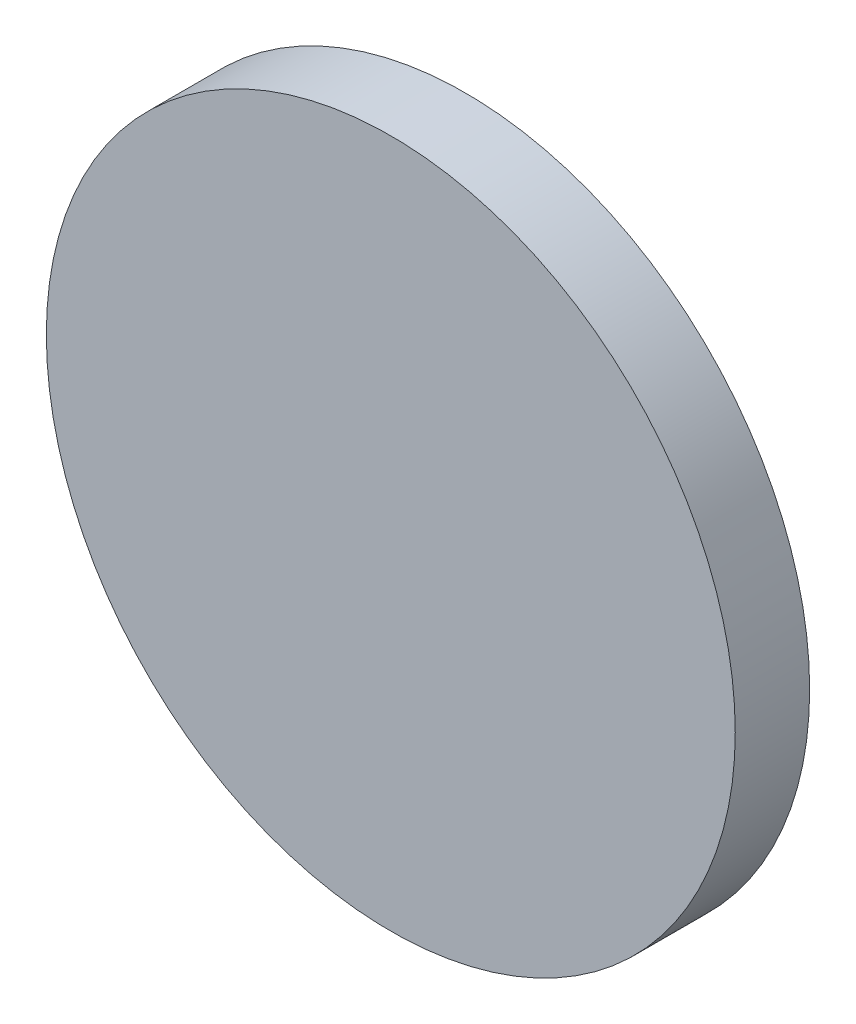
ISO-10303-21;
HEADER;
FILE_DESCRIPTION(('STEP AP214'),'2;1');
FILE_NAME('part.step','',(''),(''),'','','');
FILE_SCHEMA(('AUTOMOTIVE_DESIGN { 1 0 10303 214 1 1 1 1 }'));
ENDSEC;
DATA;
#1=APPLICATION_CONTEXT('core data for automotive mechanical design processes');
#2=APPLICATION_PROTOCOL_DEFINITION('international standard','automotive_design',2000,#1);
#3=PRODUCT_CONTEXT('',#1,'mechanical');
#4=PRODUCT('Part','Part','',(#3));
#5=PRODUCT_RELATED_PRODUCT_CATEGORY('part','',(#4));
#6=PRODUCT_DEFINITION_FORMATION('','',#4);
#7=PRODUCT_DEFINITION_CONTEXT('part definition',#1,'design');
#8=PRODUCT_DEFINITION('design','',#6,#7);
#9=PRODUCT_DEFINITION_SHAPE('','',#8);
#10=(LENGTH_UNIT() NAMED_UNIT(*) SI_UNIT(.MILLI.,.METRE.));
#11=(NAMED_UNIT(*) PLANE_ANGLE_UNIT() SI_UNIT($,.RADIAN.));
#12=(NAMED_UNIT(*) SI_UNIT($,.STERADIAN.) SOLID_ANGLE_UNIT());
#13=UNCERTAINTY_MEASURE_WITH_UNIT(LENGTH_MEASURE(1.E-05),#10,'distance_accuracy_value','');
#14=(GEOMETRIC_REPRESENTATION_CONTEXT(3) GLOBAL_UNCERTAINTY_ASSIGNED_CONTEXT((#13)) GLOBAL_UNIT_ASSIGNED_CONTEXT((#10,
#11,#12)) REPRESENTATION_CONTEXT('',''));
#15=CARTESIAN_POINT('',(0.,0.,0.));
#16=DIRECTION('',(0.,0.,1.));
#17=DIRECTION('',(1.,0.,0.));
#18=AXIS2_PLACEMENT_3D('',#15,#16,#17);
#19=CARTESIAN_POINT('',(0.,0.,6.9342));
#20=DIRECTION('',(0.,0.,-1.));
#21=DIRECTION('',(-1.,0.,0.));
#22=AXIS2_PLACEMENT_3D('',#19,#20,#21);
#23=CYLINDRICAL_SURFACE('',#22,32.09925);
#24=CARTESIAN_POINT('',(0.,0.,6.9342));
#25=DIRECTION('',(0.,0.,1.));
#26=DIRECTION('',(1.,0.,0.));
#27=AXIS2_PLACEMENT_3D('',#24,#25,#26);
#28=CIRCLE('',#27,32.09925);
#29=CARTESIAN_POINT('',(32.09925,0.,6.9342));
#30=VERTEX_POINT('',#29);
#31=EDGE_CURVE('E10',#30,#30,#28,.T.);
#32=ORIENTED_EDGE('',*,*,#31,.F.);
#33=EDGE_LOOP('',(#32));
#34=FACE_BOUND('',#33,.T.);
#35=CARTESIAN_POINT('',(0.,0.,0.));
#36=DIRECTION('',(0.,0.,1.));
#37=DIRECTION('',(1.,0.,0.));
#38=AXIS2_PLACEMENT_3D('',#35,#36,#37);
#39=CIRCLE('',#38,32.09925);
#40=CARTESIAN_POINT('',(32.09925,0.,0.));
#41=VERTEX_POINT('',#40);
#42=EDGE_CURVE('E35',#41,#41,#39,.T.);
#43=ORIENTED_EDGE('',*,*,#42,.T.);
#44=EDGE_LOOP('',(#43));
#45=FACE_BOUND('',#44,.T.);
#46=ADVANCED_FACE('F32',(#34,#45),#23,.T.);
#47=CARTESIAN_POINT('',(0.,0.,6.9342));
#48=DIRECTION('',(0.,0.,1.));
#49=DIRECTION('',(1.,0.,0.));
#50=AXIS2_PLACEMENT_3D('',#47,#48,#49);
#51=PLANE('',#50);
#52=ORIENTED_EDGE('',*,*,#31,.T.);
#53=EDGE_LOOP('',(#52));
#54=FACE_BOUND('',#53,.T.);
#55=ADVANCED_FACE('F47',(#54),#51,.T.);
#56=CARTESIAN_POINT('',(0.,0.,0.));
#57=DIRECTION('',(0.,0.,1.));
#58=DIRECTION('',(1.,0.,0.));
#59=AXIS2_PLACEMENT_3D('',#56,#57,#58);
#60=PLANE('',#59);
#61=ORIENTED_EDGE('',*,*,#42,.F.);
#62=EDGE_LOOP('',(#61));
#63=FACE_BOUND('',#62,.T.);
#64=ADVANCED_FACE('F45',(#63),#60,.F.);
#65=CLOSED_SHELL('',(#46,#55,#64));
#66=MANIFOLD_SOLID_BREP('B2',#65);
#67=ADVANCED_BREP_SHAPE_REPRESENTATION('',(#18,#66),#14);
#68=SHAPE_DEFINITION_REPRESENTATION(#9,#67);
ENDSEC;
END-ISO-10303-21;
